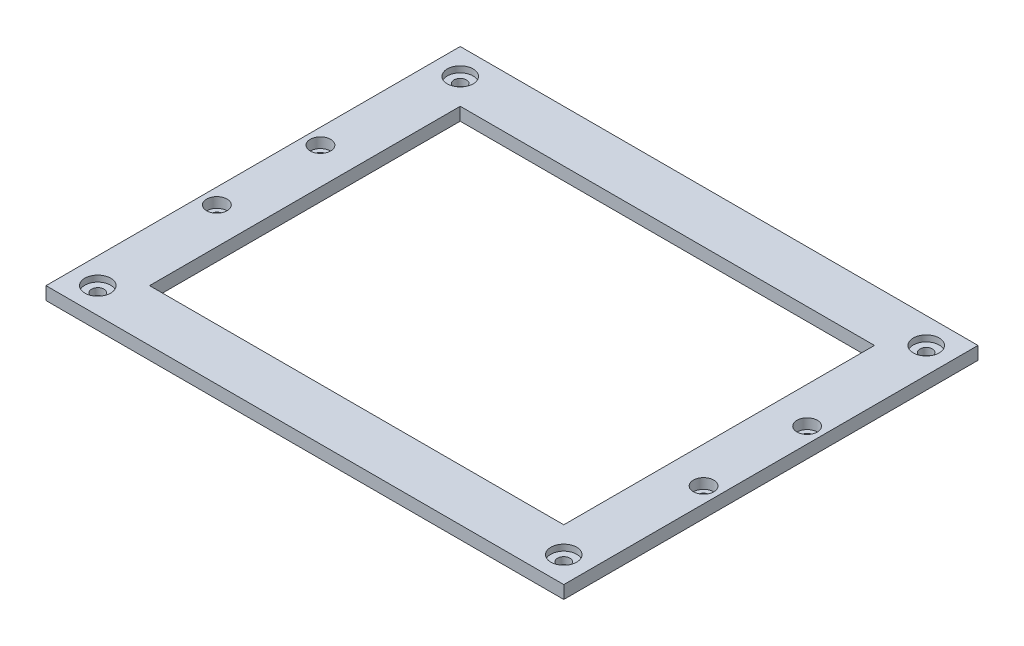
ISO-10303-21;
HEADER;
FILE_DESCRIPTION(('STEP AP214'),'2;1');
FILE_NAME('part.step','',(''),(''),'','','');
FILE_SCHEMA(('AUTOMOTIVE_DESIGN { 1 0 10303 214 1 1 1 1 }'));
ENDSEC;
DATA;
#1=APPLICATION_CONTEXT('core data for automotive mechanical design processes');
#2=APPLICATION_PROTOCOL_DEFINITION('international standard','automotive_design',2000,#1);
#3=PRODUCT_CONTEXT('',#1,'mechanical');
#4=PRODUCT('Part','Part','',(#3));
#5=PRODUCT_RELATED_PRODUCT_CATEGORY('part','',(#4));
#6=PRODUCT_DEFINITION_FORMATION('','',#4);
#7=PRODUCT_DEFINITION_CONTEXT('part definition',#1,'design');
#8=PRODUCT_DEFINITION('design','',#6,#7);
#9=PRODUCT_DEFINITION_SHAPE('','',#8);
#10=(LENGTH_UNIT() NAMED_UNIT(*) SI_UNIT(.MILLI.,.METRE.));
#11=(NAMED_UNIT(*) PLANE_ANGLE_UNIT() SI_UNIT($,.RADIAN.));
#12=(NAMED_UNIT(*) SI_UNIT($,.STERADIAN.) SOLID_ANGLE_UNIT());
#13=UNCERTAINTY_MEASURE_WITH_UNIT(LENGTH_MEASURE(1.E-05),#10,'distance_accuracy_value','');
#14=(GEOMETRIC_REPRESENTATION_CONTEXT(3) GLOBAL_UNCERTAINTY_ASSIGNED_CONTEXT((#13)) GLOBAL_UNIT_ASSIGNED_CONTEXT((#10,
#11,#12)) REPRESENTATION_CONTEXT('',''));
#15=CARTESIAN_POINT('',(0.,0.,0.));
#16=DIRECTION('',(0.,0.,1.));
#17=DIRECTION('',(1.,0.,0.));
#18=AXIS2_PLACEMENT_3D('',#15,#16,#17);
#19=CARTESIAN_POINT('',(12.7,6.35,-190.5));
#20=DIRECTION('',(0.,-1.,0.));
#21=DIRECTION('',(0.,0.,-1.));
#22=AXIS2_PLACEMENT_3D('',#19,#20,#21);
#23=CYLINDRICAL_SURFACE('',#22,3.05);
#24=CARTESIAN_POINT('',(12.7,0.,-190.5));
#25=DIRECTION('',(0.,1.,0.));
#26=DIRECTION('',(0.,0.,1.));
#27=AXIS2_PLACEMENT_3D('',#24,#25,#26);
#28=CIRCLE('',#27,3.05);
#29=CARTESIAN_POINT('',(12.7,0.,-187.45));
#30=VERTEX_POINT('',#29);
#31=EDGE_CURVE('E142',#30,#30,#28,.T.);
#32=ORIENTED_EDGE('',*,*,#31,.F.);
#33=EDGE_LOOP('',(#32));
#34=FACE_BOUND('',#33,.T.);
#35=CARTESIAN_POINT('',(12.7,3.35,-190.5));
#36=DIRECTION('',(0.,1.,0.));
#37=DIRECTION('',(0.,0.,1.));
#38=AXIS2_PLACEMENT_3D('',#35,#36,#37);
#39=CIRCLE('',#38,3.05);
#40=CARTESIAN_POINT('',(12.7,3.35,-187.45));
#41=VERTEX_POINT('',#40);
#42=EDGE_CURVE('E43',#41,#41,#39,.T.);
#43=ORIENTED_EDGE('',*,*,#42,.T.);
#44=EDGE_LOOP('',(#43));
#45=FACE_BOUND('',#44,.T.);
#46=ADVANCED_FACE('F39',(#34,#45),#23,.F.);
#47=CARTESIAN_POINT('',(241.3,6.35,-190.5));
#48=DIRECTION('',(0.,-1.,0.));
#49=DIRECTION('',(0.,0.,-1.));
#50=AXIS2_PLACEMENT_3D('',#47,#48,#49);
#51=CYLINDRICAL_SURFACE('',#50,3.04999999999999);
#52=CARTESIAN_POINT('',(241.3,0.,-190.5));
#53=DIRECTION('',(0.,1.,0.));
#54=DIRECTION('',(0.,0.,1.));
#55=AXIS2_PLACEMENT_3D('',#52,#53,#54);
#56=CIRCLE('',#55,3.04999999999999);
#57=CARTESIAN_POINT('',(241.3,0.,-187.45));
#58=VERTEX_POINT('',#57);
#59=EDGE_CURVE('E220',#58,#58,#56,.T.);
#60=ORIENTED_EDGE('',*,*,#59,.F.);
#61=EDGE_LOOP('',(#60));
#62=FACE_BOUND('',#61,.T.);
#63=CARTESIAN_POINT('',(241.3,3.35,-190.5));
#64=DIRECTION('',(0.,1.,0.));
#65=DIRECTION('',(0.,0.,1.));
#66=AXIS2_PLACEMENT_3D('',#63,#64,#65);
#67=CIRCLE('',#66,3.04999999999999);
#68=CARTESIAN_POINT('',(241.3,3.35,-187.45));
#69=VERTEX_POINT('',#68);
#70=EDGE_CURVE('E202',#69,#69,#67,.T.);
#71=ORIENTED_EDGE('',*,*,#70,.T.);
#72=EDGE_LOOP('',(#71));
#73=FACE_BOUND('',#72,.T.);
#74=ADVANCED_FACE('F236',(#62,#73),#51,.F.);
#75=CARTESIAN_POINT('',(241.3,6.35,-12.7));
#76=DIRECTION('',(0.,-1.,0.));
#77=DIRECTION('',(0.,0.,-1.));
#78=AXIS2_PLACEMENT_3D('',#75,#76,#77);
#79=CYLINDRICAL_SURFACE('',#78,3.04999999999999);
#80=CARTESIAN_POINT('',(241.3,0.,-12.7));
#81=DIRECTION('',(0.,1.,0.));
#82=DIRECTION('',(0.,0.,1.));
#83=AXIS2_PLACEMENT_3D('',#80,#81,#82);
#84=CIRCLE('',#83,3.04999999999999);
#85=CARTESIAN_POINT('',(241.3,0.,-9.65000000000001));
#86=VERTEX_POINT('',#85);
#87=EDGE_CURVE('E214',#86,#86,#84,.T.);
#88=ORIENTED_EDGE('',*,*,#87,.F.);
#89=EDGE_LOOP('',(#88));
#90=FACE_BOUND('',#89,.T.);
#91=CARTESIAN_POINT('',(241.3,3.35,-12.7));
#92=DIRECTION('',(0.,1.,0.));
#93=DIRECTION('',(0.,0.,1.));
#94=AXIS2_PLACEMENT_3D('',#91,#92,#93);
#95=CIRCLE('',#94,3.04999999999999);
#96=CARTESIAN_POINT('',(241.3,3.35,-9.65000000000001));
#97=VERTEX_POINT('',#96);
#98=EDGE_CURVE('E198',#97,#97,#95,.T.);
#99=ORIENTED_EDGE('',*,*,#98,.T.);
#100=EDGE_LOOP('',(#99));
#101=FACE_BOUND('',#100,.T.);
#102=ADVANCED_FACE('F241',(#90,#101),#79,.F.);
#103=CARTESIAN_POINT('',(12.7,6.35,-12.7));
#104=DIRECTION('',(0.,-1.,0.));
#105=DIRECTION('',(0.,0.,-1.));
#106=AXIS2_PLACEMENT_3D('',#103,#104,#105);
#107=CYLINDRICAL_SURFACE('',#106,3.05);
#108=CARTESIAN_POINT('',(12.7,0.,-12.7));
#109=DIRECTION('',(0.,1.,0.));
#110=DIRECTION('',(0.,0.,1.));
#111=AXIS2_PLACEMENT_3D('',#108,#109,#110);
#112=CIRCLE('',#111,3.05);
#113=CARTESIAN_POINT('',(12.7,0.,-9.65));
#114=VERTEX_POINT('',#113);
#115=EDGE_CURVE('E209',#114,#114,#112,.T.);
#116=ORIENTED_EDGE('',*,*,#115,.F.);
#117=EDGE_LOOP('',(#116));
#118=FACE_BOUND('',#117,.T.);
#119=CARTESIAN_POINT('',(12.7,3.35,-12.7));
#120=DIRECTION('',(0.,1.,0.));
#121=DIRECTION('',(0.,0.,1.));
#122=AXIS2_PLACEMENT_3D('',#119,#120,#121);
#123=CIRCLE('',#122,3.05);
#124=CARTESIAN_POINT('',(12.7,3.35,-9.65));
#125=VERTEX_POINT('',#124);
#126=EDGE_CURVE('E194',#125,#125,#123,.T.);
#127=ORIENTED_EDGE('',*,*,#126,.T.);
#128=EDGE_LOOP('',(#127));
#129=FACE_BOUND('',#128,.T.);
#130=ADVANCED_FACE('F261',(#118,#129),#107,.F.);
#131=CARTESIAN_POINT('',(0.,6.35,0.));
#132=DIRECTION('',(0.,-1.,0.));
#133=DIRECTION('',(0.,0.,-1.));
#134=AXIS2_PLACEMENT_3D('',#131,#132,#133);
#135=PLANE('',#134);
#136=CARTESIAN_POINT('',(246.38,6.35,-76.2));
#137=DIRECTION('',(0.,1.,0.));
#138=DIRECTION('',(0.,0.,1.));
#139=AXIS2_PLACEMENT_3D('',#136,#137,#138);
#140=CIRCLE('',#139,4.99999999999998);
#141=CARTESIAN_POINT('',(246.38,6.35,-71.2));
#142=VERTEX_POINT('',#141);
#143=EDGE_CURVE('E580',#142,#142,#140,.T.);
#144=ORIENTED_EDGE('',*,*,#143,.F.);
#145=EDGE_LOOP('',(#144));
#146=FACE_BOUND('',#145,.T.);
#147=CARTESIAN_POINT('',(246.38,6.35,-127.));
#148=DIRECTION('',(0.,1.,0.));
#149=DIRECTION('',(0.,0.,1.));
#150=AXIS2_PLACEMENT_3D('',#147,#148,#149);
#151=CIRCLE('',#150,4.99999999999998);
#152=CARTESIAN_POINT('',(246.38,6.35,-122.));
#153=VERTEX_POINT('',#152);
#154=EDGE_CURVE('E594',#153,#153,#151,.T.);
#155=ORIENTED_EDGE('',*,*,#154,.F.);
#156=EDGE_LOOP('',(#155));
#157=FACE_BOUND('',#156,.T.);
#158=CARTESIAN_POINT('',(7.62,6.35,-76.2));
#159=DIRECTION('',(0.,1.,0.));
#160=DIRECTION('',(0.,0.,1.));
#161=AXIS2_PLACEMENT_3D('',#158,#159,#160);
#162=CIRCLE('',#161,5.);
#163=CARTESIAN_POINT('',(7.62,6.35,-71.2));
#164=VERTEX_POINT('',#163);
#165=EDGE_CURVE('E610',#164,#164,#162,.T.);
#166=ORIENTED_EDGE('',*,*,#165,.F.);
#167=EDGE_LOOP('',(#166));
#168=FACE_BOUND('',#167,.T.);
#169=CARTESIAN_POINT('',(7.61999999999999,6.35,-127.));
#170=DIRECTION('',(0.,1.,0.));
#171=DIRECTION('',(0.,0.,1.));
#172=AXIS2_PLACEMENT_3D('',#169,#170,#171);
#173=CIRCLE('',#172,5.);
#174=CARTESIAN_POINT('',(7.61999999999999,6.35,-122.));
#175=VERTEX_POINT('',#174);
#176=EDGE_CURVE('E626',#175,#175,#173,.T.);
#177=ORIENTED_EDGE('',*,*,#176,.F.);
#178=EDGE_LOOP('',(#177));
#179=FACE_BOUND('',#178,.T.);
#180=CARTESIAN_POINT('',(12.7,6.35,-12.7));
#181=DIRECTION('',(0.,1.,0.));
#182=DIRECTION('',(0.,0.,1.));
#183=AXIS2_PLACEMENT_3D('',#180,#181,#182);
#184=CIRCLE('',#183,6.35);
#185=CARTESIAN_POINT('',(12.7,6.35,-6.35));
#186=VERTEX_POINT('',#185);
#187=EDGE_CURVE('E642',#186,#186,#184,.T.);
#188=ORIENTED_EDGE('',*,*,#187,.F.);
#189=EDGE_LOOP('',(#188));
#190=FACE_BOUND('',#189,.T.);
#191=CARTESIAN_POINT('',(241.3,6.35,-12.7));
#192=DIRECTION('',(0.,1.,0.));
#193=DIRECTION('',(0.,0.,1.));
#194=AXIS2_PLACEMENT_3D('',#191,#192,#193);
#195=CIRCLE('',#194,6.35);
#196=CARTESIAN_POINT('',(241.3,6.35,-6.35));
#197=VERTEX_POINT('',#196);
#198=EDGE_CURVE('E655',#197,#197,#195,.T.);
#199=ORIENTED_EDGE('',*,*,#198,.F.);
#200=EDGE_LOOP('',(#199));
#201=FACE_BOUND('',#200,.T.);
#202=CARTESIAN_POINT('',(241.3,6.35,-190.5));
#203=DIRECTION('',(0.,1.,0.));
#204=DIRECTION('',(0.,0.,1.));
#205=AXIS2_PLACEMENT_3D('',#202,#203,#204);
#206=CIRCLE('',#205,6.34999999999999);
#207=CARTESIAN_POINT('',(241.3,6.35,-184.15));
#208=VERTEX_POINT('',#207);
#209=EDGE_CURVE('E647',#208,#208,#206,.T.);
#210=ORIENTED_EDGE('',*,*,#209,.F.);
#211=EDGE_LOOP('',(#210));
#212=FACE_BOUND('',#211,.T.);
#213=CARTESIAN_POINT('',(12.7,6.35,-190.5));
#214=DIRECTION('',(0.,1.,0.));
#215=DIRECTION('',(0.,0.,1.));
#216=AXIS2_PLACEMENT_3D('',#213,#214,#215);
#217=CIRCLE('',#216,6.35);
#218=CARTESIAN_POINT('',(12.7,6.35,-184.15));
#219=VERTEX_POINT('',#218);
#220=EDGE_CURVE('E223',#219,#219,#217,.T.);
#221=ORIENTED_EDGE('',*,*,#220,.F.);
#222=EDGE_LOOP('',(#221));
#223=FACE_BOUND('',#222,.T.);
#224=DIRECTION('',(0.,0.,1.));
#225=VECTOR('',#224,1.);
#226=CARTESIAN_POINT('',(0.,6.35,0.));
#227=LINE('',#226,#225);
#228=CARTESIAN_POINT('',(0.,6.35,-203.2));
#229=VERTEX_POINT('',#228);
#230=CARTESIAN_POINT('',(0.,6.35,0.));
#231=VERTEX_POINT('',#230);
#232=EDGE_CURVE('E158',#229,#231,#227,.T.);
#233=ORIENTED_EDGE('',*,*,#232,.T.);
#234=DIRECTION('',(1.,0.,0.));
#235=VECTOR('',#234,1.);
#236=CARTESIAN_POINT('',(0.,6.35,0.));
#237=LINE('',#236,#235);
#238=CARTESIAN_POINT('',(254.,6.35,0.));
#239=VERTEX_POINT('',#238);
#240=EDGE_CURVE('E162',#231,#239,#237,.T.);
#241=ORIENTED_EDGE('',*,*,#240,.T.);
#242=DIRECTION('',(0.,0.,-1.));
#243=VECTOR('',#242,1.);
#244=CARTESIAN_POINT('',(254.,6.35,0.));
#245=LINE('',#244,#243);
#246=CARTESIAN_POINT('',(254.,6.35,-203.2));
#247=VERTEX_POINT('',#246);
#248=EDGE_CURVE('E166',#239,#247,#245,.T.);
#249=ORIENTED_EDGE('',*,*,#248,.T.);
#250=DIRECTION('',(-1.,0.,0.));
#251=VECTOR('',#250,1.);
#252=CARTESIAN_POINT('',(0.,6.35,-203.2));
#253=LINE('',#252,#251);
#254=EDGE_CURVE('E169',#247,#229,#253,.T.);
#255=ORIENTED_EDGE('',*,*,#254,.T.);
#256=EDGE_LOOP('',(#233,#241,#249,#255));
#257=FACE_BOUND('',#256,.T.);
#258=DIRECTION('',(0.,0.,1.));
#259=VECTOR('',#258,1.);
#260=CARTESIAN_POINT('',(25.4,6.35,-177.8));
#261=LINE('',#260,#259);
#262=CARTESIAN_POINT('',(25.4,6.35,-177.8));
#263=VERTEX_POINT('',#262);
#264=CARTESIAN_POINT('',(25.4,6.35,-25.4));
#265=VERTEX_POINT('',#264);
#266=EDGE_CURVE('E107',#263,#265,#261,.T.);
#267=ORIENTED_EDGE('',*,*,#266,.F.);
#268=DIRECTION('',(-1.,0.,0.));
#269=VECTOR('',#268,1.);
#270=CARTESIAN_POINT('',(25.4,6.35,-177.8));
#271=LINE('',#270,#269);
#272=CARTESIAN_POINT('',(228.6,6.35,-177.8));
#273=VERTEX_POINT('',#272);
#274=EDGE_CURVE('E134',#273,#263,#271,.T.);
#275=ORIENTED_EDGE('',*,*,#274,.F.);
#276=DIRECTION('',(0.,0.,-1.));
#277=VECTOR('',#276,1.);
#278=CARTESIAN_POINT('',(228.6,6.35,-177.8));
#279=LINE('',#278,#277);
#280=CARTESIAN_POINT('',(228.6,6.35,-25.4));
#281=VERTEX_POINT('',#280);
#282=EDGE_CURVE('E130',#281,#273,#279,.T.);
#283=ORIENTED_EDGE('',*,*,#282,.F.);
#284=DIRECTION('',(1.,0.,0.));
#285=VECTOR('',#284,1.);
#286=CARTESIAN_POINT('',(25.4,6.35,-25.4));
#287=LINE('',#286,#285);
#288=EDGE_CURVE('E116',#265,#281,#287,.T.);
#289=ORIENTED_EDGE('',*,*,#288,.F.);
#290=EDGE_LOOP('',(#267,#275,#283,#289));
#291=FACE_BOUND('',#290,.T.);
#292=ADVANCED_FACE('F129',(#146,#157,#168,#179,#190,#201,#212,#223,#257,#291),#135,.F.);
#293=CARTESIAN_POINT('',(0.,0.,0.));
#294=DIRECTION('',(0.,-1.,0.));
#295=DIRECTION('',(0.,0.,-1.));
#296=AXIS2_PLACEMENT_3D('',#293,#294,#295);
#297=PLANE('',#296);
#298=CARTESIAN_POINT('',(246.38,0.,-76.2));
#299=DIRECTION('',(0.,1.,0.));
#300=DIRECTION('',(0.,0.,1.));
#301=AXIS2_PLACEMENT_3D('',#298,#299,#300);
#302=CIRCLE('',#301,2.75);
#303=CARTESIAN_POINT('',(246.38,0.,-73.45));
#304=VERTEX_POINT('',#303);
#305=EDGE_CURVE('E590',#304,#304,#302,.T.);
#306=ORIENTED_EDGE('',*,*,#305,.T.);
#307=EDGE_LOOP('',(#306));
#308=FACE_BOUND('',#307,.T.);
#309=CARTESIAN_POINT('',(246.38,0.,-127.));
#310=DIRECTION('',(0.,1.,0.));
#311=DIRECTION('',(0.,0.,1.));
#312=AXIS2_PLACEMENT_3D('',#309,#310,#311);
#313=CIRCLE('',#312,2.75);
#314=CARTESIAN_POINT('',(246.38,0.,-124.25));
#315=VERTEX_POINT('',#314);
#316=EDGE_CURVE('E606',#315,#315,#313,.T.);
#317=ORIENTED_EDGE('',*,*,#316,.T.);
#318=EDGE_LOOP('',(#317));
#319=FACE_BOUND('',#318,.T.);
#320=CARTESIAN_POINT('',(7.62,0.,-76.2));
#321=DIRECTION('',(0.,1.,0.));
#322=DIRECTION('',(0.,0.,1.));
#323=AXIS2_PLACEMENT_3D('',#320,#321,#322);
#324=CIRCLE('',#323,2.75);
#325=CARTESIAN_POINT('',(7.62,0.,-73.45));
#326=VERTEX_POINT('',#325);
#327=EDGE_CURVE('E622',#326,#326,#324,.T.);
#328=ORIENTED_EDGE('',*,*,#327,.T.);
#329=EDGE_LOOP('',(#328));
#330=FACE_BOUND('',#329,.T.);
#331=CARTESIAN_POINT('',(7.61999999999999,0.,-127.));
#332=DIRECTION('',(0.,1.,0.));
#333=DIRECTION('',(0.,0.,1.));
#334=AXIS2_PLACEMENT_3D('',#331,#332,#333);
#335=CIRCLE('',#334,2.75);
#336=CARTESIAN_POINT('',(7.61999999999999,0.,-124.25));
#337=VERTEX_POINT('',#336);
#338=EDGE_CURVE('E638',#337,#337,#335,.T.);
#339=ORIENTED_EDGE('',*,*,#338,.T.);
#340=EDGE_LOOP('',(#339));
#341=FACE_BOUND('',#340,.T.);
#342=ORIENTED_EDGE('',*,*,#87,.T.);
#343=EDGE_LOOP('',(#342));
#344=FACE_BOUND('',#343,.T.);
#345=ORIENTED_EDGE('',*,*,#31,.T.);
#346=EDGE_LOOP('',(#345));
#347=FACE_BOUND('',#346,.T.);
#348=DIRECTION('',(0.,0.,1.));
#349=VECTOR('',#348,1.);
#350=CARTESIAN_POINT('',(0.,0.,0.));
#351=LINE('',#350,#349);
#352=CARTESIAN_POINT('',(0.,0.,-203.2));
#353=VERTEX_POINT('',#352);
#354=CARTESIAN_POINT('',(0.,0.,0.));
#355=VERTEX_POINT('',#354);
#356=EDGE_CURVE('E125',#353,#355,#351,.T.);
#357=ORIENTED_EDGE('',*,*,#356,.F.);
#358=DIRECTION('',(-1.,0.,0.));
#359=VECTOR('',#358,1.);
#360=CARTESIAN_POINT('',(0.,0.,-203.2));
#361=LINE('',#360,#359);
#362=CARTESIAN_POINT('',(254.,0.,-203.2));
#363=VERTEX_POINT('',#362);
#364=EDGE_CURVE('E163',#363,#353,#361,.T.);
#365=ORIENTED_EDGE('',*,*,#364,.F.);
#366=DIRECTION('',(0.,0.,-1.));
#367=VECTOR('',#366,1.);
#368=CARTESIAN_POINT('',(254.,0.,0.));
#369=LINE('',#368,#367);
#370=CARTESIAN_POINT('',(254.,0.,0.));
#371=VERTEX_POINT('',#370);
#372=EDGE_CURVE('E179',#371,#363,#369,.T.);
#373=ORIENTED_EDGE('',*,*,#372,.F.);
#374=DIRECTION('',(1.,0.,0.));
#375=VECTOR('',#374,1.);
#376=CARTESIAN_POINT('',(0.,0.,0.));
#377=LINE('',#376,#375);
#378=EDGE_CURVE('E176',#355,#371,#377,.T.);
#379=ORIENTED_EDGE('',*,*,#378,.F.);
#380=EDGE_LOOP('',(#357,#365,#373,#379));
#381=FACE_BOUND('',#380,.T.);
#382=DIRECTION('',(-1.,0.,0.));
#383=VECTOR('',#382,1.);
#384=CARTESIAN_POINT('',(25.4,0.,-177.8));
#385=LINE('',#384,#383);
#386=CARTESIAN_POINT('',(228.6,0.,-177.8));
#387=VERTEX_POINT('',#386);
#388=CARTESIAN_POINT('',(25.4,0.,-177.8));
#389=VERTEX_POINT('',#388);
#390=EDGE_CURVE('E117',#387,#389,#385,.T.);
#391=ORIENTED_EDGE('',*,*,#390,.T.);
#392=DIRECTION('',(0.,0.,1.));
#393=VECTOR('',#392,1.);
#394=CARTESIAN_POINT('',(25.4,0.,-177.8));
#395=LINE('',#394,#393);
#396=CARTESIAN_POINT('',(25.4,0.,-25.4));
#397=VERTEX_POINT('',#396);
#398=EDGE_CURVE('E65',#389,#397,#395,.T.);
#399=ORIENTED_EDGE('',*,*,#398,.T.);
#400=DIRECTION('',(1.,0.,0.));
#401=VECTOR('',#400,1.);
#402=CARTESIAN_POINT('',(25.4,0.,-25.4));
#403=LINE('',#402,#401);
#404=CARTESIAN_POINT('',(228.6,0.,-25.4));
#405=VERTEX_POINT('',#404);
#406=EDGE_CURVE('E123',#397,#405,#403,.T.);
#407=ORIENTED_EDGE('',*,*,#406,.T.);
#408=DIRECTION('',(0.,0.,-1.));
#409=VECTOR('',#408,1.);
#410=CARTESIAN_POINT('',(228.6,0.,-177.8));
#411=LINE('',#410,#409);
#412=EDGE_CURVE('E145',#405,#387,#411,.T.);
#413=ORIENTED_EDGE('',*,*,#412,.T.);
#414=EDGE_LOOP('',(#391,#399,#407,#413));
#415=FACE_BOUND('',#414,.T.);
#416=ORIENTED_EDGE('',*,*,#59,.T.);
#417=EDGE_LOOP('',(#416));
#418=FACE_BOUND('',#417,.T.);
#419=ORIENTED_EDGE('',*,*,#115,.T.);
#420=EDGE_LOOP('',(#419));
#421=FACE_BOUND('',#420,.T.);
#422=ADVANCED_FACE('F232',(#308,#319,#330,#341,#344,#347,#381,#415,#418,#421),#297,.T.);
#423=CARTESIAN_POINT('',(0.,6.35,0.));
#424=DIRECTION('',(1.,0.,0.));
#425=DIRECTION('',(0.,0.,-1.));
#426=AXIS2_PLACEMENT_3D('',#423,#424,#425);
#427=PLANE('',#426);
#428=ORIENTED_EDGE('',*,*,#356,.T.);
#429=DIRECTION('',(0.,-1.,0.));
#430=VECTOR('',#429,1.);
#431=CARTESIAN_POINT('',(0.,6.35,0.));
#432=LINE('',#431,#430);
#433=EDGE_CURVE('E11',#231,#355,#432,.T.);
#434=ORIENTED_EDGE('',*,*,#433,.F.);
#435=ORIENTED_EDGE('',*,*,#232,.F.);
#436=DIRECTION('',(0.,-1.,0.));
#437=VECTOR('',#436,1.);
#438=CARTESIAN_POINT('',(0.,6.35,-203.2));
#439=LINE('',#438,#437);
#440=EDGE_CURVE('E172',#229,#353,#439,.T.);
#441=ORIENTED_EDGE('',*,*,#440,.T.);
#442=EDGE_LOOP('',(#428,#434,#435,#441));
#443=FACE_BOUND('',#442,.T.);
#444=ADVANCED_FACE('F41',(#443),#427,.F.);
#445=CARTESIAN_POINT('',(0.,6.35,0.));
#446=DIRECTION('',(0.,0.,-1.));
#447=DIRECTION('',(-1.,0.,0.));
#448=AXIS2_PLACEMENT_3D('',#445,#446,#447);
#449=PLANE('',#448);
#450=ORIENTED_EDGE('',*,*,#378,.T.);
#451=DIRECTION('',(0.,-1.,0.));
#452=VECTOR('',#451,1.);
#453=CARTESIAN_POINT('',(254.,6.35,0.));
#454=LINE('',#453,#452);
#455=EDGE_CURVE('E49',#239,#371,#454,.T.);
#456=ORIENTED_EDGE('',*,*,#455,.F.);
#457=ORIENTED_EDGE('',*,*,#240,.F.);
#458=ORIENTED_EDGE('',*,*,#433,.T.);
#459=EDGE_LOOP('',(#450,#456,#457,#458));
#460=FACE_BOUND('',#459,.T.);
#461=ADVANCED_FACE('F271',(#460),#449,.F.);
#462=CARTESIAN_POINT('',(254.,6.35,0.));
#463=DIRECTION('',(-1.,0.,0.));
#464=DIRECTION('',(0.,0.,1.));
#465=AXIS2_PLACEMENT_3D('',#462,#463,#464);
#466=PLANE('',#465);
#467=ORIENTED_EDGE('',*,*,#372,.T.);
#468=DIRECTION('',(0.,-1.,0.));
#469=VECTOR('',#468,1.);
#470=CARTESIAN_POINT('',(254.,6.35,-203.2));
#471=LINE('',#470,#469);
#472=EDGE_CURVE('E187',#247,#363,#471,.T.);
#473=ORIENTED_EDGE('',*,*,#472,.F.);
#474=ORIENTED_EDGE('',*,*,#248,.F.);
#475=ORIENTED_EDGE('',*,*,#455,.T.);
#476=EDGE_LOOP('',(#467,#473,#474,#475));
#477=FACE_BOUND('',#476,.T.);
#478=ADVANCED_FACE('F268',(#477),#466,.F.);
#479=CARTESIAN_POINT('',(0.,6.35,-203.2));
#480=DIRECTION('',(0.,0.,1.));
#481=DIRECTION('',(1.,0.,0.));
#482=AXIS2_PLACEMENT_3D('',#479,#480,#481);
#483=PLANE('',#482);
#484=ORIENTED_EDGE('',*,*,#364,.T.);
#485=ORIENTED_EDGE('',*,*,#440,.F.);
#486=ORIENTED_EDGE('',*,*,#254,.F.);
#487=ORIENTED_EDGE('',*,*,#472,.T.);
#488=EDGE_LOOP('',(#484,#485,#486,#487));
#489=FACE_BOUND('',#488,.T.);
#490=ADVANCED_FACE('F258',(#489),#483,.F.);
#491=CARTESIAN_POINT('',(25.4,6.35,-177.8));
#492=DIRECTION('',(1.,0.,0.));
#493=DIRECTION('',(0.,0.,-1.));
#494=AXIS2_PLACEMENT_3D('',#491,#492,#493);
#495=PLANE('',#494);
#496=ORIENTED_EDGE('',*,*,#398,.F.);
#497=DIRECTION('',(0.,-1.,0.));
#498=VECTOR('',#497,1.);
#499=CARTESIAN_POINT('',(25.4,6.35,-177.8));
#500=LINE('',#499,#498);
#501=EDGE_CURVE('E111',#263,#389,#500,.T.);
#502=ORIENTED_EDGE('',*,*,#501,.F.);
#503=ORIENTED_EDGE('',*,*,#266,.T.);
#504=DIRECTION('',(0.,-1.,0.));
#505=VECTOR('',#504,1.);
#506=CARTESIAN_POINT('',(25.4,6.35,-25.4));
#507=LINE('',#506,#505);
#508=EDGE_CURVE('E110',#265,#397,#507,.T.);
#509=ORIENTED_EDGE('',*,*,#508,.T.);
#510=EDGE_LOOP('',(#496,#502,#503,#509));
#511=FACE_BOUND('',#510,.T.);
#512=ADVANCED_FACE('F109',(#511),#495,.T.);
#513=CARTESIAN_POINT('',(25.4,6.35,-25.4));
#514=DIRECTION('',(0.,0.,-1.));
#515=DIRECTION('',(-1.,0.,0.));
#516=AXIS2_PLACEMENT_3D('',#513,#514,#515);
#517=PLANE('',#516);
#518=ORIENTED_EDGE('',*,*,#406,.F.);
#519=ORIENTED_EDGE('',*,*,#508,.F.);
#520=ORIENTED_EDGE('',*,*,#288,.T.);
#521=DIRECTION('',(0.,-1.,0.));
#522=VECTOR('',#521,1.);
#523=CARTESIAN_POINT('',(228.6,6.35,-25.4));
#524=LINE('',#523,#522);
#525=EDGE_CURVE('E126',#281,#405,#524,.T.);
#526=ORIENTED_EDGE('',*,*,#525,.T.);
#527=EDGE_LOOP('',(#518,#519,#520,#526));
#528=FACE_BOUND('',#527,.T.);
#529=ADVANCED_FACE('F120',(#528),#517,.T.);
#530=CARTESIAN_POINT('',(228.6,6.35,-177.8));
#531=DIRECTION('',(-1.,0.,0.));
#532=DIRECTION('',(0.,0.,1.));
#533=AXIS2_PLACEMENT_3D('',#530,#531,#532);
#534=PLANE('',#533);
#535=ORIENTED_EDGE('',*,*,#412,.F.);
#536=ORIENTED_EDGE('',*,*,#525,.F.);
#537=ORIENTED_EDGE('',*,*,#282,.T.);
#538=DIRECTION('',(0.,-1.,0.));
#539=VECTOR('',#538,1.);
#540=CARTESIAN_POINT('',(228.6,6.35,-177.8));
#541=LINE('',#540,#539);
#542=EDGE_CURVE('E57',#273,#387,#541,.T.);
#543=ORIENTED_EDGE('',*,*,#542,.T.);
#544=EDGE_LOOP('',(#535,#536,#537,#543));
#545=FACE_BOUND('',#544,.T.);
#546=ADVANCED_FACE('F250',(#545),#534,.T.);
#547=CARTESIAN_POINT('',(25.4,6.35,-177.8));
#548=DIRECTION('',(0.,0.,1.));
#549=DIRECTION('',(1.,0.,0.));
#550=AXIS2_PLACEMENT_3D('',#547,#548,#549);
#551=PLANE('',#550);
#552=ORIENTED_EDGE('',*,*,#390,.F.);
#553=ORIENTED_EDGE('',*,*,#542,.F.);
#554=ORIENTED_EDGE('',*,*,#274,.T.);
#555=ORIENTED_EDGE('',*,*,#501,.T.);
#556=EDGE_LOOP('',(#552,#553,#554,#555));
#557=FACE_BOUND('',#556,.T.);
#558=ADVANCED_FACE('F246',(#557),#551,.T.);
#559=CARTESIAN_POINT('',(12.7,3.35,-12.7));
#560=DIRECTION('',(0.,1.,0.));
#561=DIRECTION('',(0.,0.,1.));
#562=AXIS2_PLACEMENT_3D('',#559,#560,#561);
#563=CYLINDRICAL_SURFACE('',#562,6.35);
#564=CARTESIAN_POINT('',(12.7,3.35,-12.7));
#565=DIRECTION('',(0.,1.,0.));
#566=DIRECTION('',(0.,0.,1.));
#567=AXIS2_PLACEMENT_3D('',#564,#565,#566);
#568=CIRCLE('',#567,6.35);
#569=CARTESIAN_POINT('',(12.7,3.35,-6.35));
#570=VERTEX_POINT('',#569);
#571=EDGE_CURVE('E659',#570,#570,#568,.T.);
#572=ORIENTED_EDGE('',*,*,#571,.F.);
#573=EDGE_LOOP('',(#572));
#574=FACE_BOUND('',#573,.T.);
#575=ORIENTED_EDGE('',*,*,#187,.T.);
#576=EDGE_LOOP('',(#575));
#577=FACE_BOUND('',#576,.T.);
#578=ADVANCED_FACE('F249',(#574,#577),#563,.F.);
#579=CARTESIAN_POINT('',(12.7,3.35,-12.7));
#580=DIRECTION('',(0.,1.,0.));
#581=DIRECTION('',(0.,0.,1.));
#582=AXIS2_PLACEMENT_3D('',#579,#580,#581);
#583=PLANE('',#582);
#584=ORIENTED_EDGE('',*,*,#126,.F.);
#585=EDGE_LOOP('',(#584));
#586=FACE_BOUND('',#585,.T.);
#587=ORIENTED_EDGE('',*,*,#571,.T.);
#588=EDGE_LOOP('',(#587));
#589=FACE_BOUND('',#588,.T.);
#590=ADVANCED_FACE('F382',(#586,#589),#583,.T.);
#591=CARTESIAN_POINT('',(241.3,3.35,-12.7));
#592=DIRECTION('',(0.,1.,0.));
#593=DIRECTION('',(0.,0.,1.));
#594=AXIS2_PLACEMENT_3D('',#591,#592,#593);
#595=CYLINDRICAL_SURFACE('',#594,6.35);
#596=CARTESIAN_POINT('',(241.3,3.35,-12.7));
#597=DIRECTION('',(0.,1.,0.));
#598=DIRECTION('',(0.,0.,1.));
#599=AXIS2_PLACEMENT_3D('',#596,#597,#598);
#600=CIRCLE('',#599,6.35);
#601=CARTESIAN_POINT('',(241.3,3.35,-6.35));
#602=VERTEX_POINT('',#601);
#603=EDGE_CURVE('E651',#602,#602,#600,.T.);
#604=ORIENTED_EDGE('',*,*,#603,.F.);
#605=EDGE_LOOP('',(#604));
#606=FACE_BOUND('',#605,.T.);
#607=ORIENTED_EDGE('',*,*,#198,.T.);
#608=EDGE_LOOP('',(#607));
#609=FACE_BOUND('',#608,.T.);
#610=ADVANCED_FACE('F389',(#606,#609),#595,.F.);
#611=CARTESIAN_POINT('',(241.3,3.35,-12.7));
#612=DIRECTION('',(0.,1.,0.));
#613=DIRECTION('',(0.,0.,1.));
#614=AXIS2_PLACEMENT_3D('',#611,#612,#613);
#615=PLANE('',#614);
#616=ORIENTED_EDGE('',*,*,#98,.F.);
#617=EDGE_LOOP('',(#616));
#618=FACE_BOUND('',#617,.T.);
#619=ORIENTED_EDGE('',*,*,#603,.T.);
#620=EDGE_LOOP('',(#619));
#621=FACE_BOUND('',#620,.T.);
#622=ADVANCED_FACE('F397',(#618,#621),#615,.T.);
#623=CARTESIAN_POINT('',(241.3,3.35,-190.5));
#624=DIRECTION('',(0.,1.,0.));
#625=DIRECTION('',(0.,0.,1.));
#626=AXIS2_PLACEMENT_3D('',#623,#624,#625);
#627=CYLINDRICAL_SURFACE('',#626,6.34999999999999);
#628=CARTESIAN_POINT('',(241.3,3.35,-190.5));
#629=DIRECTION('',(0.,1.,0.));
#630=DIRECTION('',(0.,0.,1.));
#631=AXIS2_PLACEMENT_3D('',#628,#629,#630);
#632=CIRCLE('',#631,6.34999999999999);
#633=CARTESIAN_POINT('',(241.3,3.35,-184.15));
#634=VERTEX_POINT('',#633);
#635=EDGE_CURVE('E643',#634,#634,#632,.T.);
#636=ORIENTED_EDGE('',*,*,#635,.F.);
#637=EDGE_LOOP('',(#636));
#638=FACE_BOUND('',#637,.T.);
#639=ORIENTED_EDGE('',*,*,#209,.T.);
#640=EDGE_LOOP('',(#639));
#641=FACE_BOUND('',#640,.T.);
#642=ADVANCED_FACE('F405',(#638,#641),#627,.F.);
#643=CARTESIAN_POINT('',(241.3,3.35,-190.5));
#644=DIRECTION('',(0.,1.,0.));
#645=DIRECTION('',(0.,0.,1.));
#646=AXIS2_PLACEMENT_3D('',#643,#644,#645);
#647=PLANE('',#646);
#648=ORIENTED_EDGE('',*,*,#70,.F.);
#649=EDGE_LOOP('',(#648));
#650=FACE_BOUND('',#649,.T.);
#651=ORIENTED_EDGE('',*,*,#635,.T.);
#652=EDGE_LOOP('',(#651));
#653=FACE_BOUND('',#652,.T.);
#654=ADVANCED_FACE('F413',(#650,#653),#647,.T.);
#655=CARTESIAN_POINT('',(12.7,3.35,-190.5));
#656=DIRECTION('',(0.,1.,0.));
#657=DIRECTION('',(0.,0.,1.));
#658=AXIS2_PLACEMENT_3D('',#655,#656,#657);
#659=CYLINDRICAL_SURFACE('',#658,6.35);
#660=CARTESIAN_POINT('',(12.7,3.35,-190.5));
#661=DIRECTION('',(0.,1.,0.));
#662=DIRECTION('',(0.,0.,1.));
#663=AXIS2_PLACEMENT_3D('',#660,#661,#662);
#664=CIRCLE('',#663,6.35);
#665=CARTESIAN_POINT('',(12.7,3.35,-184.15));
#666=VERTEX_POINT('',#665);
#667=EDGE_CURVE('E199',#666,#666,#664,.T.);
#668=ORIENTED_EDGE('',*,*,#667,.F.);
#669=EDGE_LOOP('',(#668));
#670=FACE_BOUND('',#669,.T.);
#671=ORIENTED_EDGE('',*,*,#220,.T.);
#672=EDGE_LOOP('',(#671));
#673=FACE_BOUND('',#672,.T.);
#674=ADVANCED_FACE('F421',(#670,#673),#659,.F.);
#675=CARTESIAN_POINT('',(12.7,3.35,-190.5));
#676=DIRECTION('',(0.,1.,0.));
#677=DIRECTION('',(0.,0.,1.));
#678=AXIS2_PLACEMENT_3D('',#675,#676,#677);
#679=PLANE('',#678);
#680=ORIENTED_EDGE('',*,*,#42,.F.);
#681=EDGE_LOOP('',(#680));
#682=FACE_BOUND('',#681,.T.);
#683=ORIENTED_EDGE('',*,*,#667,.T.);
#684=EDGE_LOOP('',(#683));
#685=FACE_BOUND('',#684,.T.);
#686=ADVANCED_FACE('F429',(#682,#685),#679,.T.);
#687=CARTESIAN_POINT('',(7.61999999999999,6.35,-127.));
#688=DIRECTION('',(0.,1.,0.));
#689=DIRECTION('',(0.,0.,1.));
#690=AXIS2_PLACEMENT_3D('',#687,#688,#689);
#691=CYLINDRICAL_SURFACE('',#690,2.75);
#692=ORIENTED_EDGE('',*,*,#338,.F.);
#693=EDGE_LOOP('',(#692));
#694=FACE_BOUND('',#693,.T.);
#695=CARTESIAN_POINT('',(7.61999999999999,1.35,-127.));
#696=DIRECTION('',(0.,1.,0.));
#697=DIRECTION('',(0.,0.,1.));
#698=AXIS2_PLACEMENT_3D('',#695,#696,#697);
#699=CIRCLE('',#698,2.75);
#700=CARTESIAN_POINT('',(7.61999999999999,1.35,-124.25));
#701=VERTEX_POINT('',#700);
#702=EDGE_CURVE('E634',#701,#701,#699,.T.);
#703=ORIENTED_EDGE('',*,*,#702,.T.);
#704=EDGE_LOOP('',(#703));
#705=FACE_BOUND('',#704,.T.);
#706=ADVANCED_FACE('F436',(#694,#705),#691,.F.);
#707=CARTESIAN_POINT('',(10.37,1.35,-127.));
#708=DIRECTION('',(0.,-1.,0.));
#709=DIRECTION('',(0.,0.,-1.));
#710=AXIS2_PLACEMENT_3D('',#707,#708,#709);
#711=PLANE('',#710);
#712=ORIENTED_EDGE('',*,*,#702,.F.);
#713=EDGE_LOOP('',(#712));
#714=FACE_BOUND('',#713,.T.);
#715=CARTESIAN_POINT('',(7.61999999999999,1.35,-127.));
#716=DIRECTION('',(0.,1.,0.));
#717=DIRECTION('',(0.,0.,1.));
#718=AXIS2_PLACEMENT_3D('',#715,#716,#717);
#719=CIRCLE('',#718,5.);
#720=CARTESIAN_POINT('',(7.61999999999999,1.35,-122.));
#721=VERTEX_POINT('',#720);
#722=EDGE_CURVE('E630',#721,#721,#719,.T.);
#723=ORIENTED_EDGE('',*,*,#722,.T.);
#724=EDGE_LOOP('',(#723));
#725=FACE_BOUND('',#724,.T.);
#726=ADVANCED_FACE('F443',(#714,#725),#711,.F.);
#727=CARTESIAN_POINT('',(7.61999999999999,6.35,-127.));
#728=DIRECTION('',(0.,1.,0.));
#729=DIRECTION('',(0.,0.,1.));
#730=AXIS2_PLACEMENT_3D('',#727,#728,#729);
#731=CYLINDRICAL_SURFACE('',#730,5.);
#732=ORIENTED_EDGE('',*,*,#722,.F.);
#733=EDGE_LOOP('',(#732));
#734=FACE_BOUND('',#733,.T.);
#735=ORIENTED_EDGE('',*,*,#176,.T.);
#736=EDGE_LOOP('',(#735));
#737=FACE_BOUND('',#736,.T.);
#738=ADVANCED_FACE('F451',(#734,#737),#731,.F.);
#739=CARTESIAN_POINT('',(7.62,6.35,-76.2));
#740=DIRECTION('',(0.,1.,0.));
#741=DIRECTION('',(0.,0.,1.));
#742=AXIS2_PLACEMENT_3D('',#739,#740,#741);
#743=CYLINDRICAL_SURFACE('',#742,2.75);
#744=ORIENTED_EDGE('',*,*,#327,.F.);
#745=EDGE_LOOP('',(#744));
#746=FACE_BOUND('',#745,.T.);
#747=CARTESIAN_POINT('',(7.62,1.35,-76.2));
#748=DIRECTION('',(0.,1.,0.));
#749=DIRECTION('',(0.,0.,1.));
#750=AXIS2_PLACEMENT_3D('',#747,#748,#749);
#751=CIRCLE('',#750,2.75);
#752=CARTESIAN_POINT('',(7.62,1.35,-73.45));
#753=VERTEX_POINT('',#752);
#754=EDGE_CURVE('E618',#753,#753,#751,.T.);
#755=ORIENTED_EDGE('',*,*,#754,.T.);
#756=EDGE_LOOP('',(#755));
#757=FACE_BOUND('',#756,.T.);
#758=ADVANCED_FACE('F459',(#746,#757),#743,.F.);
#759=CARTESIAN_POINT('',(10.37,1.35,-76.2));
#760=DIRECTION('',(0.,-1.,0.));
#761=DIRECTION('',(0.,0.,-1.));
#762=AXIS2_PLACEMENT_3D('',#759,#760,#761);
#763=PLANE('',#762);
#764=ORIENTED_EDGE('',*,*,#754,.F.);
#765=EDGE_LOOP('',(#764));
#766=FACE_BOUND('',#765,.T.);
#767=CARTESIAN_POINT('',(7.62,1.35,-76.2));
#768=DIRECTION('',(0.,1.,0.));
#769=DIRECTION('',(0.,0.,1.));
#770=AXIS2_PLACEMENT_3D('',#767,#768,#769);
#771=CIRCLE('',#770,5.);
#772=CARTESIAN_POINT('',(7.62,1.35,-71.2));
#773=VERTEX_POINT('',#772);
#774=EDGE_CURVE('E614',#773,#773,#771,.T.);
#775=ORIENTED_EDGE('',*,*,#774,.T.);
#776=EDGE_LOOP('',(#775));
#777=FACE_BOUND('',#776,.T.);
#778=ADVANCED_FACE('F467',(#766,#777),#763,.F.);
#779=CARTESIAN_POINT('',(7.62,6.35,-76.2));
#780=DIRECTION('',(0.,1.,0.));
#781=DIRECTION('',(0.,0.,1.));
#782=AXIS2_PLACEMENT_3D('',#779,#780,#781);
#783=CYLINDRICAL_SURFACE('',#782,5.);
#784=ORIENTED_EDGE('',*,*,#774,.F.);
#785=EDGE_LOOP('',(#784));
#786=FACE_BOUND('',#785,.T.);
#787=ORIENTED_EDGE('',*,*,#165,.T.);
#788=EDGE_LOOP('',(#787));
#789=FACE_BOUND('',#788,.T.);
#790=ADVANCED_FACE('F475',(#786,#789),#783,.F.);
#791=CARTESIAN_POINT('',(246.38,6.35,-127.));
#792=DIRECTION('',(0.,1.,0.));
#793=DIRECTION('',(0.,0.,1.));
#794=AXIS2_PLACEMENT_3D('',#791,#792,#793);
#795=CYLINDRICAL_SURFACE('',#794,2.75);
#796=ORIENTED_EDGE('',*,*,#316,.F.);
#797=EDGE_LOOP('',(#796));
#798=FACE_BOUND('',#797,.T.);
#799=CARTESIAN_POINT('',(246.38,1.35,-127.));
#800=DIRECTION('',(0.,1.,0.));
#801=DIRECTION('',(0.,0.,1.));
#802=AXIS2_PLACEMENT_3D('',#799,#800,#801);
#803=CIRCLE('',#802,2.75);
#804=CARTESIAN_POINT('',(246.38,1.35,-124.25));
#805=VERTEX_POINT('',#804);
#806=EDGE_CURVE('E602',#805,#805,#803,.T.);
#807=ORIENTED_EDGE('',*,*,#806,.T.);
#808=EDGE_LOOP('',(#807));
#809=FACE_BOUND('',#808,.T.);
#810=ADVANCED_FACE('F483',(#798,#809),#795,.F.);
#811=CARTESIAN_POINT('',(249.13,1.35,-127.));
#812=DIRECTION('',(0.,-1.,0.));
#813=DIRECTION('',(0.,0.,-1.));
#814=AXIS2_PLACEMENT_3D('',#811,#812,#813);
#815=PLANE('',#814);
#816=ORIENTED_EDGE('',*,*,#806,.F.);
#817=EDGE_LOOP('',(#816));
#818=FACE_BOUND('',#817,.T.);
#819=CARTESIAN_POINT('',(246.38,1.35,-127.));
#820=DIRECTION('',(0.,1.,0.));
#821=DIRECTION('',(0.,0.,1.));
#822=AXIS2_PLACEMENT_3D('',#819,#820,#821);
#823=CIRCLE('',#822,4.99999999999998);
#824=CARTESIAN_POINT('',(246.38,1.35,-122.));
#825=VERTEX_POINT('',#824);
#826=EDGE_CURVE('E598',#825,#825,#823,.T.);
#827=ORIENTED_EDGE('',*,*,#826,.T.);
#828=EDGE_LOOP('',(#827));
#829=FACE_BOUND('',#828,.T.);
#830=ADVANCED_FACE('F491',(#818,#829),#815,.F.);
#831=CARTESIAN_POINT('',(246.38,6.35,-127.));
#832=DIRECTION('',(0.,1.,0.));
#833=DIRECTION('',(0.,0.,1.));
#834=AXIS2_PLACEMENT_3D('',#831,#832,#833);
#835=CYLINDRICAL_SURFACE('',#834,4.99999999999998);
#836=ORIENTED_EDGE('',*,*,#826,.F.);
#837=EDGE_LOOP('',(#836));
#838=FACE_BOUND('',#837,.T.);
#839=ORIENTED_EDGE('',*,*,#154,.T.);
#840=EDGE_LOOP('',(#839));
#841=FACE_BOUND('',#840,.T.);
#842=ADVANCED_FACE('F499',(#838,#841),#835,.F.);
#843=CARTESIAN_POINT('',(246.38,6.35,-76.2));
#844=DIRECTION('',(0.,1.,0.));
#845=DIRECTION('',(0.,0.,1.));
#846=AXIS2_PLACEMENT_3D('',#843,#844,#845);
#847=CYLINDRICAL_SURFACE('',#846,2.75);
#848=ORIENTED_EDGE('',*,*,#305,.F.);
#849=EDGE_LOOP('',(#848));
#850=FACE_BOUND('',#849,.T.);
#851=CARTESIAN_POINT('',(246.38,1.35,-76.2));
#852=DIRECTION('',(0.,1.,0.));
#853=DIRECTION('',(0.,0.,1.));
#854=AXIS2_PLACEMENT_3D('',#851,#852,#853);
#855=CIRCLE('',#854,2.75);
#856=CARTESIAN_POINT('',(246.38,1.35,-73.45));
#857=VERTEX_POINT('',#856);
#858=EDGE_CURVE('E584',#857,#857,#855,.T.);
#859=ORIENTED_EDGE('',*,*,#858,.T.);
#860=EDGE_LOOP('',(#859));
#861=FACE_BOUND('',#860,.T.);
#862=ADVANCED_FACE('F507',(#850,#861),#847,.F.);
#863=CARTESIAN_POINT('',(249.13,1.35,-76.2));
#864=DIRECTION('',(0.,-1.,0.));
#865=DIRECTION('',(0.,0.,-1.));
#866=AXIS2_PLACEMENT_3D('',#863,#864,#865);
#867=PLANE('',#866);
#868=ORIENTED_EDGE('',*,*,#858,.F.);
#869=EDGE_LOOP('',(#868));
#870=FACE_BOUND('',#869,.T.);
#871=CARTESIAN_POINT('',(246.38,1.35,-76.2));
#872=DIRECTION('',(0.,1.,0.));
#873=DIRECTION('',(0.,0.,1.));
#874=AXIS2_PLACEMENT_3D('',#871,#872,#873);
#875=CIRCLE('',#874,4.99999999999998);
#876=CARTESIAN_POINT('',(246.38,1.35,-71.2));
#877=VERTEX_POINT('',#876);
#878=EDGE_CURVE('E577',#877,#877,#875,.T.);
#879=ORIENTED_EDGE('',*,*,#878,.T.);
#880=EDGE_LOOP('',(#879));
#881=FACE_BOUND('',#880,.T.);
#882=ADVANCED_FACE('F515',(#870,#881),#867,.F.);
#883=CARTESIAN_POINT('',(246.38,6.35,-76.2));
#884=DIRECTION('',(0.,1.,0.));
#885=DIRECTION('',(0.,0.,1.));
#886=AXIS2_PLACEMENT_3D('',#883,#884,#885);
#887=CYLINDRICAL_SURFACE('',#886,4.99999999999998);
#888=ORIENTED_EDGE('',*,*,#878,.F.);
#889=EDGE_LOOP('',(#888));
#890=FACE_BOUND('',#889,.T.);
#891=ORIENTED_EDGE('',*,*,#143,.T.);
#892=EDGE_LOOP('',(#891));
#893=FACE_BOUND('',#892,.T.);
#894=ADVANCED_FACE('F523',(#890,#893),#887,.F.);
#895=CLOSED_SHELL('',(#46,#74,#102,#130,#292,#422,#444,#461,#478,#490,#512,#529,#546,#558,#578,
#590,#610,#622,#642,#654,#674,#686,#706,#726,#738,#758,#778,#790,#810,#830,#842,#862,#882,#894));
#896=MANIFOLD_SOLID_BREP('B2',#895);
#897=ADVANCED_BREP_SHAPE_REPRESENTATION('',(#18,#896),#14);
#898=SHAPE_DEFINITION_REPRESENTATION(#9,#897);
ENDSEC;
END-ISO-10303-21;
